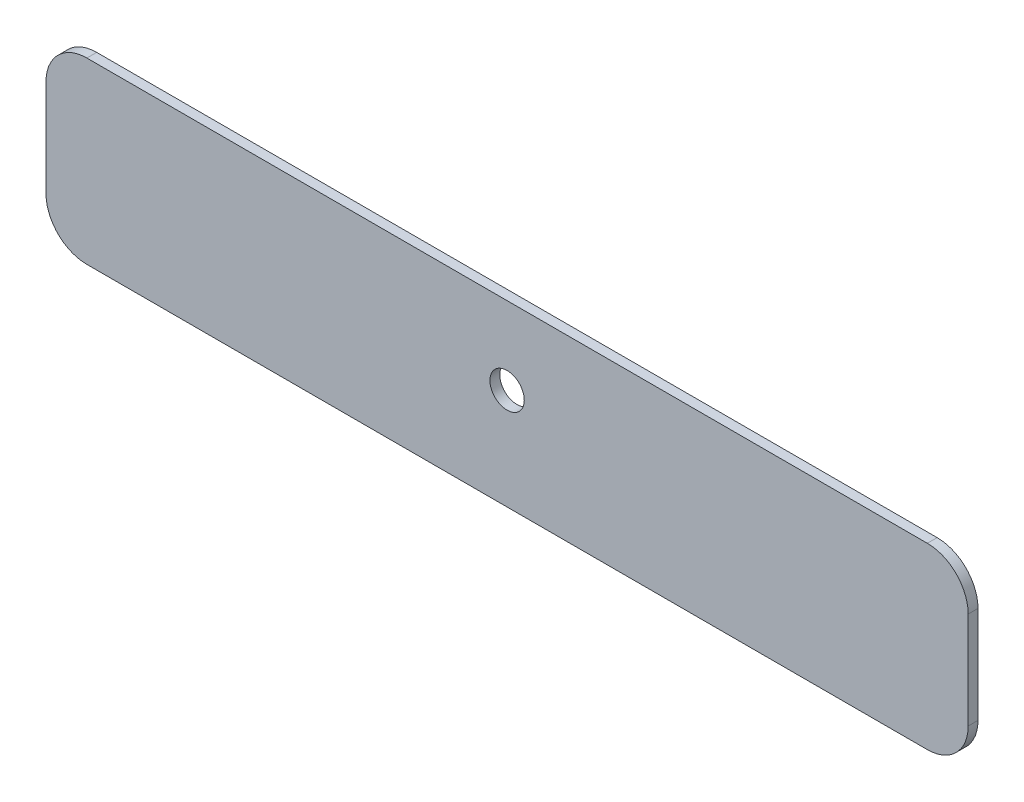
ISO-10303-21;
HEADER;
FILE_DESCRIPTION(('STEP AP214'),'2;1');
FILE_NAME('part.step','',(''),(''),'','','');
FILE_SCHEMA(('AUTOMOTIVE_DESIGN { 1 0 10303 214 1 1 1 1 }'));
ENDSEC;
DATA;
#1=APPLICATION_CONTEXT('core data for automotive mechanical design processes');
#2=APPLICATION_PROTOCOL_DEFINITION('international standard','automotive_design',2000,#1);
#3=PRODUCT_CONTEXT('',#1,'mechanical');
#4=PRODUCT('Part','Part','',(#3));
#5=PRODUCT_RELATED_PRODUCT_CATEGORY('part','',(#4));
#6=PRODUCT_DEFINITION_FORMATION('','',#4);
#7=PRODUCT_DEFINITION_CONTEXT('part definition',#1,'design');
#8=PRODUCT_DEFINITION('design','',#6,#7);
#9=PRODUCT_DEFINITION_SHAPE('','',#8);
#10=(LENGTH_UNIT() NAMED_UNIT(*) SI_UNIT(.MILLI.,.METRE.));
#11=(NAMED_UNIT(*) PLANE_ANGLE_UNIT() SI_UNIT($,.RADIAN.));
#12=(NAMED_UNIT(*) SI_UNIT($,.STERADIAN.) SOLID_ANGLE_UNIT());
#13=UNCERTAINTY_MEASURE_WITH_UNIT(LENGTH_MEASURE(1.E-05),#10,'distance_accuracy_value','');
#14=(GEOMETRIC_REPRESENTATION_CONTEXT(3) GLOBAL_UNCERTAINTY_ASSIGNED_CONTEXT((#13)) GLOBAL_UNIT_ASSIGNED_CONTEXT((#10,
#11,#12)) REPRESENTATION_CONTEXT('',''));
#15=CARTESIAN_POINT('',(0.,0.,0.));
#16=DIRECTION('',(0.,0.,1.));
#17=DIRECTION('',(1.,0.,0.));
#18=AXIS2_PLACEMENT_3D('',#15,#16,#17);
#19=CARTESIAN_POINT('',(0.,0.,1.2));
#20=DIRECTION('',(0.,0.,1.));
#21=DIRECTION('',(1.,0.,0.));
#22=AXIS2_PLACEMENT_3D('',#19,#20,#21);
#23=PLANE('',#22);
#24=DIRECTION('',(0.,1.,0.));
#25=VECTOR('',#24,1.);
#26=CARTESIAN_POINT('',(56.3999999999996,136.5,1.2));
#27=LINE('',#26,#25);
#28=CARTESIAN_POINT('',(56.3999999999996,119.638335015501,1.2));
#29=VERTEX_POINT('',#28);
#30=CARTESIAN_POINT('',(56.3999999999996,131.5,1.2));
#31=VERTEX_POINT('',#30);
#32=EDGE_CURVE('E137',#29,#31,#27,.T.);
#33=ORIENTED_EDGE('',*,*,#32,.T.);
#34=CARTESIAN_POINT('',(51.3999999999996,131.5,1.2));
#35=DIRECTION('',(0.,0.,1.));
#36=DIRECTION('',(1.,0.,0.));
#37=AXIS2_PLACEMENT_3D('',#34,#35,#36);
#38=CIRCLE('',#37,5.);
#39=CARTESIAN_POINT('',(51.3999999999996,136.5,1.2));
#40=VERTEX_POINT('',#39);
#41=EDGE_CURVE('E152',#31,#40,#38,.T.);
#42=ORIENTED_EDGE('',*,*,#41,.T.);
#43=DIRECTION('',(-1.,0.,0.));
#44=VECTOR('',#43,1.);
#45=CARTESIAN_POINT('',(0.,136.5,1.2));
#46=LINE('',#45,#44);
#47=CARTESIAN_POINT('',(-51.4,136.5,1.2));
#48=VERTEX_POINT('',#47);
#49=EDGE_CURVE('E119',#40,#48,#46,.T.);
#50=ORIENTED_EDGE('',*,*,#49,.T.);
#51=CARTESIAN_POINT('',(-51.4,131.5,1.2));
#52=DIRECTION('',(0.,0.,1.));
#53=DIRECTION('',(1.,0.,0.));
#54=AXIS2_PLACEMENT_3D('',#51,#52,#53);
#55=CIRCLE('',#54,5.);
#56=CARTESIAN_POINT('',(-56.4,131.5,1.2));
#57=VERTEX_POINT('',#56);
#58=EDGE_CURVE('E147',#48,#57,#55,.T.);
#59=ORIENTED_EDGE('',*,*,#58,.T.);
#60=DIRECTION('',(0.,-1.,0.));
#61=VECTOR('',#60,1.);
#62=CARTESIAN_POINT('',(-56.4,136.5,1.2));
#63=LINE('',#62,#61);
#64=CARTESIAN_POINT('',(-56.4,119.638335015501,1.2));
#65=VERTEX_POINT('',#64);
#66=EDGE_CURVE('E163',#57,#65,#63,.T.);
#67=ORIENTED_EDGE('',*,*,#66,.T.);
#68=CARTESIAN_POINT('',(-51.4,119.638335015501,1.2));
#69=DIRECTION('',(0.,0.,1.));
#70=DIRECTION('',(1.,0.,0.));
#71=AXIS2_PLACEMENT_3D('',#68,#69,#70);
#72=CIRCLE('',#71,5.);
#73=CARTESIAN_POINT('',(-51.4,114.638335015501,1.2));
#74=VERTEX_POINT('',#73);
#75=EDGE_CURVE('E55',#65,#74,#72,.T.);
#76=ORIENTED_EDGE('',*,*,#75,.T.);
#77=DIRECTION('',(1.,0.,0.));
#78=VECTOR('',#77,1.);
#79=CARTESIAN_POINT('',(-56.4,114.638335015501,1.2));
#80=LINE('',#79,#78);
#81=CARTESIAN_POINT('',(51.3999999999996,114.638335015501,1.2));
#82=VERTEX_POINT('',#81);
#83=EDGE_CURVE('E138',#74,#82,#80,.T.);
#84=ORIENTED_EDGE('',*,*,#83,.T.);
#85=CARTESIAN_POINT('',(51.3999999999996,119.638335015501,1.2));
#86=DIRECTION('',(0.,0.,1.));
#87=DIRECTION('',(1.,0.,0.));
#88=AXIS2_PLACEMENT_3D('',#85,#86,#87);
#89=CIRCLE('',#88,5.);
#90=EDGE_CURVE('E150',#82,#29,#89,.T.);
#91=ORIENTED_EDGE('',*,*,#90,.T.);
#92=EDGE_LOOP('',(#33,#42,#50,#59,#67,#76,#84,#91));
#93=FACE_BOUND('',#92,.T.);
#94=CARTESIAN_POINT('',(0.,127.,1.2));
#95=DIRECTION('',(0.,0.,1.));
#96=DIRECTION('',(1.,0.,0.));
#97=AXIS2_PLACEMENT_3D('',#94,#95,#96);
#98=CIRCLE('',#97,2.09999999999999);
#99=CARTESIAN_POINT('',(2.09999999999998,127.,1.2));
#100=VERTEX_POINT('',#99);
#101=EDGE_CURVE('E132',#100,#100,#98,.T.);
#102=ORIENTED_EDGE('',*,*,#101,.F.);
#103=EDGE_LOOP('',(#102));
#104=FACE_BOUND('',#103,.T.);
#105=ADVANCED_FACE('F33',(#93,#104),#23,.T.);
#106=CARTESIAN_POINT('',(0.,0.,0.));
#107=DIRECTION('',(0.,0.,1.));
#108=DIRECTION('',(1.,0.,0.));
#109=AXIS2_PLACEMENT_3D('',#106,#107,#108);
#110=PLANE('',#109);
#111=DIRECTION('',(-1.,0.,0.));
#112=VECTOR('',#111,1.);
#113=CARTESIAN_POINT('',(0.,136.5,0.));
#114=LINE('',#113,#112);
#115=CARTESIAN_POINT('',(51.3999999999996,136.5,0.));
#116=VERTEX_POINT('',#115);
#117=CARTESIAN_POINT('',(-51.4,136.5,0.));
#118=VERTEX_POINT('',#117);
#119=EDGE_CURVE('E116',#116,#118,#114,.T.);
#120=ORIENTED_EDGE('',*,*,#119,.F.);
#121=CARTESIAN_POINT('',(51.3999999999996,131.5,0.));
#122=DIRECTION('',(0.,0.,1.));
#123=DIRECTION('',(1.,0.,0.));
#124=AXIS2_PLACEMENT_3D('',#121,#122,#123);
#125=CIRCLE('',#124,5.);
#126=CARTESIAN_POINT('',(56.3999999999996,131.5,0.));
#127=VERTEX_POINT('',#126);
#128=EDGE_CURVE('E99',#116,#127,#125,.F.);
#129=ORIENTED_EDGE('',*,*,#128,.T.);
#130=DIRECTION('',(0.,1.,0.));
#131=VECTOR('',#130,1.);
#132=CARTESIAN_POINT('',(56.3999999999996,136.5,0.));
#133=LINE('',#132,#131);
#134=CARTESIAN_POINT('',(56.3999999999996,119.638335015501,0.));
#135=VERTEX_POINT('',#134);
#136=EDGE_CURVE('E127',#135,#127,#133,.T.);
#137=ORIENTED_EDGE('',*,*,#136,.F.);
#138=CARTESIAN_POINT('',(51.3999999999996,119.638335015501,0.));
#139=DIRECTION('',(0.,0.,1.));
#140=DIRECTION('',(1.,0.,0.));
#141=AXIS2_PLACEMENT_3D('',#138,#139,#140);
#142=CIRCLE('',#141,5.);
#143=CARTESIAN_POINT('',(51.3999999999996,114.638335015501,0.));
#144=VERTEX_POINT('',#143);
#145=EDGE_CURVE('E110',#135,#144,#142,.F.);
#146=ORIENTED_EDGE('',*,*,#145,.T.);
#147=DIRECTION('',(1.,0.,0.));
#148=VECTOR('',#147,1.);
#149=CARTESIAN_POINT('',(-56.4,114.638335015501,0.));
#150=LINE('',#149,#148);
#151=CARTESIAN_POINT('',(-51.4,114.638335015501,0.));
#152=VERTEX_POINT('',#151);
#153=EDGE_CURVE('E130',#152,#144,#150,.T.);
#154=ORIENTED_EDGE('',*,*,#153,.F.);
#155=CARTESIAN_POINT('',(-51.4,119.638335015501,0.));
#156=DIRECTION('',(0.,0.,1.));
#157=DIRECTION('',(1.,0.,0.));
#158=AXIS2_PLACEMENT_3D('',#155,#156,#157);
#159=CIRCLE('',#158,5.);
#160=CARTESIAN_POINT('',(-56.4,119.638335015501,0.));
#161=VERTEX_POINT('',#160);
#162=EDGE_CURVE('E141',#152,#161,#159,.F.);
#163=ORIENTED_EDGE('',*,*,#162,.T.);
#164=DIRECTION('',(0.,-1.,0.));
#165=VECTOR('',#164,1.);
#166=CARTESIAN_POINT('',(-56.4,136.5,0.));
#167=LINE('',#166,#165);
#168=CARTESIAN_POINT('',(-56.4,131.5,0.));
#169=VERTEX_POINT('',#168);
#170=EDGE_CURVE('E126',#169,#161,#167,.T.);
#171=ORIENTED_EDGE('',*,*,#170,.F.);
#172=CARTESIAN_POINT('',(-51.4,131.5,0.));
#173=DIRECTION('',(0.,0.,1.));
#174=DIRECTION('',(1.,0.,0.));
#175=AXIS2_PLACEMENT_3D('',#172,#173,#174);
#176=CIRCLE('',#175,5.);
#177=EDGE_CURVE('E120',#169,#118,#176,.F.);
#178=ORIENTED_EDGE('',*,*,#177,.T.);
#179=EDGE_LOOP('',(#120,#129,#137,#146,#154,#163,#171,#178));
#180=FACE_BOUND('',#179,.T.);
#181=CARTESIAN_POINT('',(0.,127.,0.));
#182=DIRECTION('',(0.,0.,1.));
#183=DIRECTION('',(1.,0.,0.));
#184=AXIS2_PLACEMENT_3D('',#181,#182,#183);
#185=CIRCLE('',#184,2.09999999999999);
#186=CARTESIAN_POINT('',(2.09999999999998,127.,0.));
#187=VERTEX_POINT('',#186);
#188=EDGE_CURVE('E177',#187,#187,#185,.T.);
#189=ORIENTED_EDGE('',*,*,#188,.T.);
#190=EDGE_LOOP('',(#189));
#191=FACE_BOUND('',#190,.T.);
#192=ADVANCED_FACE('F123',(#180,#191),#110,.F.);
#193=CARTESIAN_POINT('',(56.3999999999996,136.5,1.2));
#194=DIRECTION('',(-1.,0.,0.));
#195=DIRECTION('',(0.,-1.,0.));
#196=AXIS2_PLACEMENT_3D('',#193,#194,#195);
#197=PLANE('',#196);
#198=ORIENTED_EDGE('',*,*,#136,.T.);
#199=DIRECTION('',(0.,0.,-1.));
#200=VECTOR('',#199,1.);
#201=CARTESIAN_POINT('',(56.3999999999996,131.5,1.2));
#202=LINE('',#201,#200);
#203=EDGE_CURVE('E104',#127,#31,#202,.F.);
#204=ORIENTED_EDGE('',*,*,#203,.T.);
#205=ORIENTED_EDGE('',*,*,#32,.F.);
#206=DIRECTION('',(0.,0.,-1.));
#207=VECTOR('',#206,1.);
#208=CARTESIAN_POINT('',(56.3999999999996,119.638335015501,1.2));
#209=LINE('',#208,#207);
#210=EDGE_CURVE('E109',#29,#135,#209,.T.);
#211=ORIENTED_EDGE('',*,*,#210,.T.);
#212=EDGE_LOOP('',(#198,#204,#205,#211));
#213=FACE_BOUND('',#212,.T.);
#214=ADVANCED_FACE('F191',(#213),#197,.F.);
#215=CARTESIAN_POINT('',(0.,136.5,1.2));
#216=DIRECTION('',(0.,-1.,0.));
#217=DIRECTION('',(0.,0.,-1.));
#218=AXIS2_PLACEMENT_3D('',#215,#216,#217);
#219=PLANE('',#218);
#220=ORIENTED_EDGE('',*,*,#49,.F.);
#221=DIRECTION('',(0.,0.,-1.));
#222=VECTOR('',#221,1.);
#223=CARTESIAN_POINT('',(51.3999999999996,136.5,1.2));
#224=LINE('',#223,#222);
#225=EDGE_CURVE('E103',#40,#116,#224,.T.);
#226=ORIENTED_EDGE('',*,*,#225,.T.);
#227=ORIENTED_EDGE('',*,*,#119,.T.);
#228=DIRECTION('',(0.,0.,-1.));
#229=VECTOR('',#228,1.);
#230=CARTESIAN_POINT('',(-51.4,136.5,1.2));
#231=LINE('',#230,#229);
#232=EDGE_CURVE('E121',#118,#48,#231,.F.);
#233=ORIENTED_EDGE('',*,*,#232,.T.);
#234=EDGE_LOOP('',(#220,#226,#227,#233));
#235=FACE_BOUND('',#234,.T.);
#236=ADVANCED_FACE('F115',(#235),#219,.F.);
#237=CARTESIAN_POINT('',(-56.4,136.5,1.2));
#238=DIRECTION('',(1.,0.,0.));
#239=DIRECTION('',(0.,0.,-1.));
#240=AXIS2_PLACEMENT_3D('',#237,#238,#239);
#241=PLANE('',#240);
#242=ORIENTED_EDGE('',*,*,#170,.T.);
#243=DIRECTION('',(0.,0.,-1.));
#244=VECTOR('',#243,1.);
#245=CARTESIAN_POINT('',(-56.4,119.638335015501,1.2));
#246=LINE('',#245,#244);
#247=EDGE_CURVE('E11',#161,#65,#246,.F.);
#248=ORIENTED_EDGE('',*,*,#247,.T.);
#249=ORIENTED_EDGE('',*,*,#66,.F.);
#250=DIRECTION('',(0.,0.,-1.));
#251=VECTOR('',#250,1.);
#252=CARTESIAN_POINT('',(-56.4,131.5,1.2));
#253=LINE('',#252,#251);
#254=EDGE_CURVE('E41',#57,#169,#253,.T.);
#255=ORIENTED_EDGE('',*,*,#254,.T.);
#256=EDGE_LOOP('',(#242,#248,#249,#255));
#257=FACE_BOUND('',#256,.T.);
#258=ADVANCED_FACE('F161',(#257),#241,.F.);
#259=CARTESIAN_POINT('',(-56.4,114.638335015501,1.2));
#260=DIRECTION('',(0.,1.,0.));
#261=DIRECTION('',(0.,0.,1.));
#262=AXIS2_PLACEMENT_3D('',#259,#260,#261);
#263=PLANE('',#262);
#264=ORIENTED_EDGE('',*,*,#153,.T.);
#265=DIRECTION('',(0.,0.,-1.));
#266=VECTOR('',#265,1.);
#267=CARTESIAN_POINT('',(51.3999999999996,114.638335015501,1.2));
#268=LINE('',#267,#266);
#269=EDGE_CURVE('E48',#144,#82,#268,.F.);
#270=ORIENTED_EDGE('',*,*,#269,.T.);
#271=ORIENTED_EDGE('',*,*,#83,.F.);
#272=DIRECTION('',(0.,0.,-1.));
#273=VECTOR('',#272,1.);
#274=CARTESIAN_POINT('',(-51.4,114.638335015501,1.2));
#275=LINE('',#274,#273);
#276=EDGE_CURVE('E154',#74,#152,#275,.T.);
#277=ORIENTED_EDGE('',*,*,#276,.T.);
#278=EDGE_LOOP('',(#264,#270,#271,#277));
#279=FACE_BOUND('',#278,.T.);
#280=ADVANCED_FACE('F170',(#279),#263,.F.);
#281=CARTESIAN_POINT('',(0.,127.,1.2));
#282=DIRECTION('',(0.,0.,-1.));
#283=DIRECTION('',(-1.,0.,0.));
#284=AXIS2_PLACEMENT_3D('',#281,#282,#283);
#285=CYLINDRICAL_SURFACE('',#284,2.09999999999999);
#286=ORIENTED_EDGE('',*,*,#101,.T.);
#287=EDGE_LOOP('',(#286));
#288=FACE_BOUND('',#287,.T.);
#289=ORIENTED_EDGE('',*,*,#188,.F.);
#290=EDGE_LOOP('',(#289));
#291=FACE_BOUND('',#290,.T.);
#292=ADVANCED_FACE('F183',(#288,#291),#285,.F.);
#293=CARTESIAN_POINT('',(51.3999999999996,131.5,1.2));
#294=DIRECTION('',(0.,0.,-1.));
#295=DIRECTION('',(-1.,0.,0.));
#296=AXIS2_PLACEMENT_3D('',#293,#294,#295);
#297=CYLINDRICAL_SURFACE('',#296,5.);
#298=ORIENTED_EDGE('',*,*,#41,.F.);
#299=ORIENTED_EDGE('',*,*,#203,.F.);
#300=ORIENTED_EDGE('',*,*,#128,.F.);
#301=ORIENTED_EDGE('',*,*,#225,.F.);
#302=EDGE_LOOP('',(#298,#299,#300,#301));
#303=FACE_BOUND('',#302,.T.);
#304=ADVANCED_FACE('F102',(#303),#297,.T.);
#305=CARTESIAN_POINT('',(51.3999999999996,119.638335015501,1.2));
#306=DIRECTION('',(0.,0.,-1.));
#307=DIRECTION('',(-1.,0.,0.));
#308=AXIS2_PLACEMENT_3D('',#305,#306,#307);
#309=CYLINDRICAL_SURFACE('',#308,5.);
#310=ORIENTED_EDGE('',*,*,#90,.F.);
#311=ORIENTED_EDGE('',*,*,#269,.F.);
#312=ORIENTED_EDGE('',*,*,#145,.F.);
#313=ORIENTED_EDGE('',*,*,#210,.F.);
#314=EDGE_LOOP('',(#310,#311,#312,#313));
#315=FACE_BOUND('',#314,.T.);
#316=ADVANCED_FACE('F206',(#315),#309,.T.);
#317=CARTESIAN_POINT('',(-51.4,119.638335015501,1.2));
#318=DIRECTION('',(0.,0.,-1.));
#319=DIRECTION('',(-1.,0.,0.));
#320=AXIS2_PLACEMENT_3D('',#317,#318,#319);
#321=CYLINDRICAL_SURFACE('',#320,5.);
#322=ORIENTED_EDGE('',*,*,#75,.F.);
#323=ORIENTED_EDGE('',*,*,#247,.F.);
#324=ORIENTED_EDGE('',*,*,#162,.F.);
#325=ORIENTED_EDGE('',*,*,#276,.F.);
#326=EDGE_LOOP('',(#322,#323,#324,#325));
#327=FACE_BOUND('',#326,.T.);
#328=ADVANCED_FACE('F169',(#327),#321,.T.);
#329=CARTESIAN_POINT('',(-51.4,131.5,1.2));
#330=DIRECTION('',(0.,0.,-1.));
#331=DIRECTION('',(-1.,0.,0.));
#332=AXIS2_PLACEMENT_3D('',#329,#330,#331);
#333=CYLINDRICAL_SURFACE('',#332,5.);
#334=ORIENTED_EDGE('',*,*,#58,.F.);
#335=ORIENTED_EDGE('',*,*,#232,.F.);
#336=ORIENTED_EDGE('',*,*,#177,.F.);
#337=ORIENTED_EDGE('',*,*,#254,.F.);
#338=EDGE_LOOP('',(#334,#335,#336,#337));
#339=FACE_BOUND('',#338,.T.);
#340=ADVANCED_FACE('F35',(#339),#333,.T.);
#341=CLOSED_SHELL('',(#105,#192,#214,#236,#258,#280,#292,#304,#316,#328,#340));
#342=MANIFOLD_SOLID_BREP('B2',#341);
#343=ADVANCED_BREP_SHAPE_REPRESENTATION('',(#18,#342),#14);
#344=SHAPE_DEFINITION_REPRESENTATION(#9,#343);
ENDSEC;
END-ISO-10303-21;
